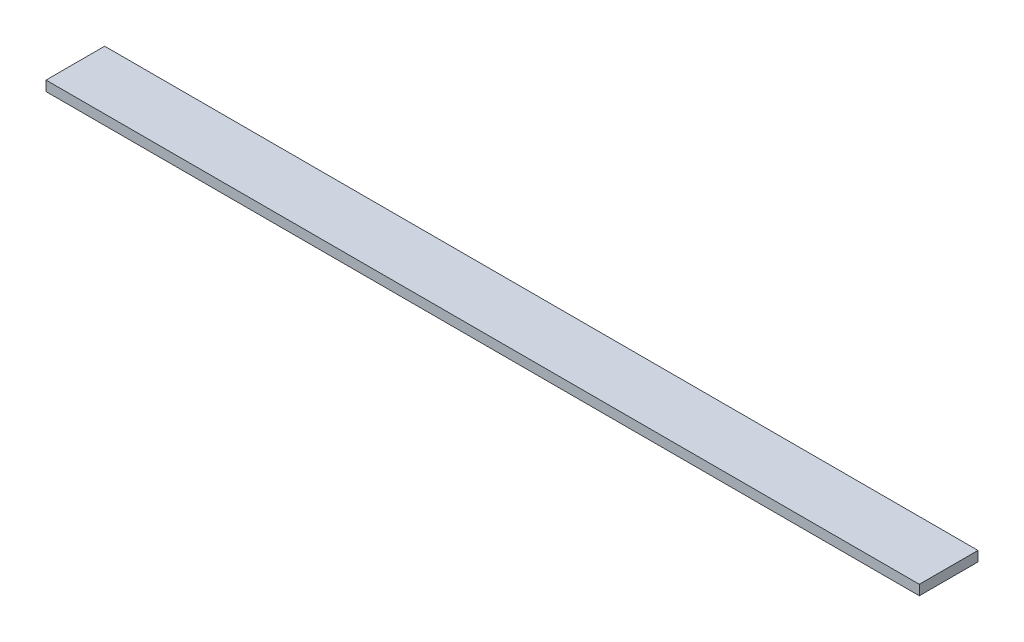
ISO-10303-21;
HEADER;
FILE_DESCRIPTION(('STEP AP214'),'2;1');
FILE_NAME('part.step','',(''),(''),'','','');
FILE_SCHEMA(('AUTOMOTIVE_DESIGN { 1 0 10303 214 1 1 1 1 }'));
ENDSEC;
DATA;
#1=APPLICATION_CONTEXT('core data for automotive mechanical design processes');
#2=APPLICATION_PROTOCOL_DEFINITION('international standard','automotive_design',2000,#1);
#3=PRODUCT_CONTEXT('',#1,'mechanical');
#4=PRODUCT('Part','Part','',(#3));
#5=PRODUCT_RELATED_PRODUCT_CATEGORY('part','',(#4));
#6=PRODUCT_DEFINITION_FORMATION('','',#4);
#7=PRODUCT_DEFINITION_CONTEXT('part definition',#1,'design');
#8=PRODUCT_DEFINITION('design','',#6,#7);
#9=PRODUCT_DEFINITION_SHAPE('','',#8);
#10=(LENGTH_UNIT() NAMED_UNIT(*) SI_UNIT(.MILLI.,.METRE.));
#11=(NAMED_UNIT(*) PLANE_ANGLE_UNIT() SI_UNIT($,.RADIAN.));
#12=(NAMED_UNIT(*) SI_UNIT($,.STERADIAN.) SOLID_ANGLE_UNIT());
#13=UNCERTAINTY_MEASURE_WITH_UNIT(LENGTH_MEASURE(1.E-05),#10,'distance_accuracy_value','');
#14=(GEOMETRIC_REPRESENTATION_CONTEXT(3) GLOBAL_UNCERTAINTY_ASSIGNED_CONTEXT((#13)) GLOBAL_UNIT_ASSIGNED_CONTEXT((#10,
#11,#12)) REPRESENTATION_CONTEXT('',''));
#15=CARTESIAN_POINT('',(0.,0.,0.));
#16=DIRECTION('',(0.,0.,1.));
#17=DIRECTION('',(1.,0.,0.));
#18=AXIS2_PLACEMENT_3D('',#15,#16,#17);
#19=CARTESIAN_POINT('',(0.,5.,0.));
#20=DIRECTION('',(0.,1.,0.));
#21=DIRECTION('',(0.,0.,1.));
#22=AXIS2_PLACEMENT_3D('',#19,#20,#21);
#23=PLANE('',#22);
#24=DIRECTION('',(-1.,0.,0.));
#25=VECTOR('',#24,1.);
#26=CARTESIAN_POINT('',(201.,5.,-13.5));
#27=LINE('',#26,#25);
#28=CARTESIAN_POINT('',(-201.,5.,-13.5));
#29=VERTEX_POINT('',#28);
#30=CARTESIAN_POINT('',(201.,5.,-13.5));
#31=VERTEX_POINT('',#30);
#32=EDGE_CURVE('E68',#29,#31,#27,.F.);
#33=ORIENTED_EDGE('',*,*,#32,.F.);
#34=DIRECTION('',(0.,0.,1.));
#35=VECTOR('',#34,1.);
#36=CARTESIAN_POINT('',(-201.,5.,-13.5));
#37=LINE('',#36,#35);
#38=CARTESIAN_POINT('',(-201.,5.,13.5));
#39=VERTEX_POINT('',#38);
#40=EDGE_CURVE('E20',#39,#29,#37,.F.);
#41=ORIENTED_EDGE('',*,*,#40,.F.);
#42=DIRECTION('',(1.,0.,0.));
#43=VECTOR('',#42,1.);
#44=CARTESIAN_POINT('',(-201.,5.,13.5));
#45=LINE('',#44,#43);
#46=CARTESIAN_POINT('',(201.,5.,13.5));
#47=VERTEX_POINT('',#46);
#48=EDGE_CURVE('E58',#47,#39,#45,.F.);
#49=ORIENTED_EDGE('',*,*,#48,.F.);
#50=DIRECTION('',(0.,0.,-1.));
#51=VECTOR('',#50,1.);
#52=CARTESIAN_POINT('',(201.,5.,13.5));
#53=LINE('',#52,#51);
#54=EDGE_CURVE('E53',#31,#47,#53,.F.);
#55=ORIENTED_EDGE('',*,*,#54,.F.);
#56=EDGE_LOOP('',(#33,#41,#49,#55));
#57=FACE_BOUND('',#56,.T.);
#58=ADVANCED_FACE('F17',(#57),#23,.T.);
#59=CARTESIAN_POINT('',(-201.,0.,-13.5));
#60=DIRECTION('',(-1.,0.,0.));
#61=DIRECTION('',(0.,0.,1.));
#62=AXIS2_PLACEMENT_3D('',#59,#60,#61);
#63=PLANE('',#62);
#64=DIRECTION('',(0.,1.,0.));
#65=VECTOR('',#64,1.);
#66=CARTESIAN_POINT('',(-201.,0.,-13.5));
#67=LINE('',#66,#65);
#68=CARTESIAN_POINT('',(-201.,0.4,-13.5));
#69=VERTEX_POINT('',#68);
#70=EDGE_CURVE('E79',#69,#29,#67,.T.);
#71=ORIENTED_EDGE('',*,*,#70,.F.);
#72=DIRECTION('',(0.,0.,1.));
#73=VECTOR('',#72,1.);
#74=CARTESIAN_POINT('',(-201.,0.4,220.863011818));
#75=LINE('',#74,#73);
#76=CARTESIAN_POINT('',(-201.,0.4,13.5));
#77=VERTEX_POINT('',#76);
#78=EDGE_CURVE('E74',#69,#77,#75,.T.);
#79=ORIENTED_EDGE('',*,*,#78,.T.);
#80=DIRECTION('',(0.,1.,0.));
#81=VECTOR('',#80,1.);
#82=CARTESIAN_POINT('',(-201.,0.,13.5));
#83=LINE('',#82,#81);
#84=EDGE_CURVE('E63',#39,#77,#83,.F.);
#85=ORIENTED_EDGE('',*,*,#84,.F.);
#86=ORIENTED_EDGE('',*,*,#40,.T.);
#87=EDGE_LOOP('',(#71,#79,#85,#86));
#88=FACE_BOUND('',#87,.T.);
#89=ADVANCED_FACE('F73',(#88),#63,.T.);
#90=CARTESIAN_POINT('',(-201.,0.,13.5));
#91=DIRECTION('',(0.,0.,1.));
#92=DIRECTION('',(1.,0.,0.));
#93=AXIS2_PLACEMENT_3D('',#90,#91,#92);
#94=PLANE('',#93);
#95=ORIENTED_EDGE('',*,*,#84,.T.);
#96=DIRECTION('',(1.,0.,0.));
#97=VECTOR('',#96,1.);
#98=CARTESIAN_POINT('',(-331.,0.4,13.5));
#99=LINE('',#98,#97);
#100=CARTESIAN_POINT('',(201.,0.4,13.5));
#101=VERTEX_POINT('',#100);
#102=EDGE_CURVE('E84',#77,#101,#99,.T.);
#103=ORIENTED_EDGE('',*,*,#102,.T.);
#104=DIRECTION('',(0.,1.,0.));
#105=VECTOR('',#104,1.);
#106=CARTESIAN_POINT('',(201.,0.,13.5));
#107=LINE('',#106,#105);
#108=EDGE_CURVE('E65',#47,#101,#107,.F.);
#109=ORIENTED_EDGE('',*,*,#108,.F.);
#110=ORIENTED_EDGE('',*,*,#48,.T.);
#111=EDGE_LOOP('',(#95,#103,#109,#110));
#112=FACE_BOUND('',#111,.T.);
#113=ADVANCED_FACE('F60',(#112),#94,.T.);
#114=CARTESIAN_POINT('',(201.,0.,13.5));
#115=DIRECTION('',(1.,0.,0.));
#116=DIRECTION('',(0.,0.,-1.));
#117=AXIS2_PLACEMENT_3D('',#114,#115,#116);
#118=PLANE('',#117);
#119=ORIENTED_EDGE('',*,*,#108,.T.);
#120=DIRECTION('',(0.,0.,1.));
#121=VECTOR('',#120,1.);
#122=CARTESIAN_POINT('',(201.,0.4,220.863011818));
#123=LINE('',#122,#121);
#124=CARTESIAN_POINT('',(201.,0.4,-13.5));
#125=VERTEX_POINT('',#124);
#126=EDGE_CURVE('E26',#101,#125,#123,.F.);
#127=ORIENTED_EDGE('',*,*,#126,.T.);
#128=DIRECTION('',(0.,1.,0.));
#129=VECTOR('',#128,1.);
#130=CARTESIAN_POINT('',(201.,0.,-13.5));
#131=LINE('',#130,#129);
#132=EDGE_CURVE('E34',#31,#125,#131,.F.);
#133=ORIENTED_EDGE('',*,*,#132,.F.);
#134=ORIENTED_EDGE('',*,*,#54,.T.);
#135=EDGE_LOOP('',(#119,#127,#133,#134));
#136=FACE_BOUND('',#135,.T.);
#137=ADVANCED_FACE('F88',(#136),#118,.T.);
#138=CARTESIAN_POINT('',(201.,0.,-13.5));
#139=DIRECTION('',(0.,0.,-1.));
#140=DIRECTION('',(-1.,0.,0.));
#141=AXIS2_PLACEMENT_3D('',#138,#139,#140);
#142=PLANE('',#141);
#143=ORIENTED_EDGE('',*,*,#132,.T.);
#144=DIRECTION('',(1.,0.,0.));
#145=VECTOR('',#144,1.);
#146=CARTESIAN_POINT('',(-331.,0.4,-13.5));
#147=LINE('',#146,#145);
#148=EDGE_CURVE('E11',#125,#69,#147,.F.);
#149=ORIENTED_EDGE('',*,*,#148,.T.);
#150=ORIENTED_EDGE('',*,*,#70,.T.);
#151=ORIENTED_EDGE('',*,*,#32,.T.);
#152=EDGE_LOOP('',(#143,#149,#150,#151));
#153=FACE_BOUND('',#152,.T.);
#154=ADVANCED_FACE('F91',(#153),#142,.T.);
#155=CARTESIAN_POINT('',(-331.,0.4,220.863011818));
#156=DIRECTION('',(0.,1.,0.));
#157=DIRECTION('',(0.,0.,1.));
#158=AXIS2_PLACEMENT_3D('',#155,#156,#157);
#159=PLANE('',#158);
#160=ORIENTED_EDGE('',*,*,#126,.F.);
#161=ORIENTED_EDGE('',*,*,#102,.F.);
#162=ORIENTED_EDGE('',*,*,#78,.F.);
#163=ORIENTED_EDGE('',*,*,#148,.F.);
#164=EDGE_LOOP('',(#160,#161,#162,#163));
#165=FACE_BOUND('',#164,.T.);
#166=ADVANCED_FACE('F90',(#165),#159,.F.);
#167=CLOSED_SHELL('',(#58,#89,#113,#137,#154,#166));
#168=MANIFOLD_SOLID_BREP('B1',#167);
#169=ADVANCED_BREP_SHAPE_REPRESENTATION('',(#18,#168),#14);
#170=SHAPE_DEFINITION_REPRESENTATION(#9,#169);
ENDSEC;
END-ISO-10303-21;
